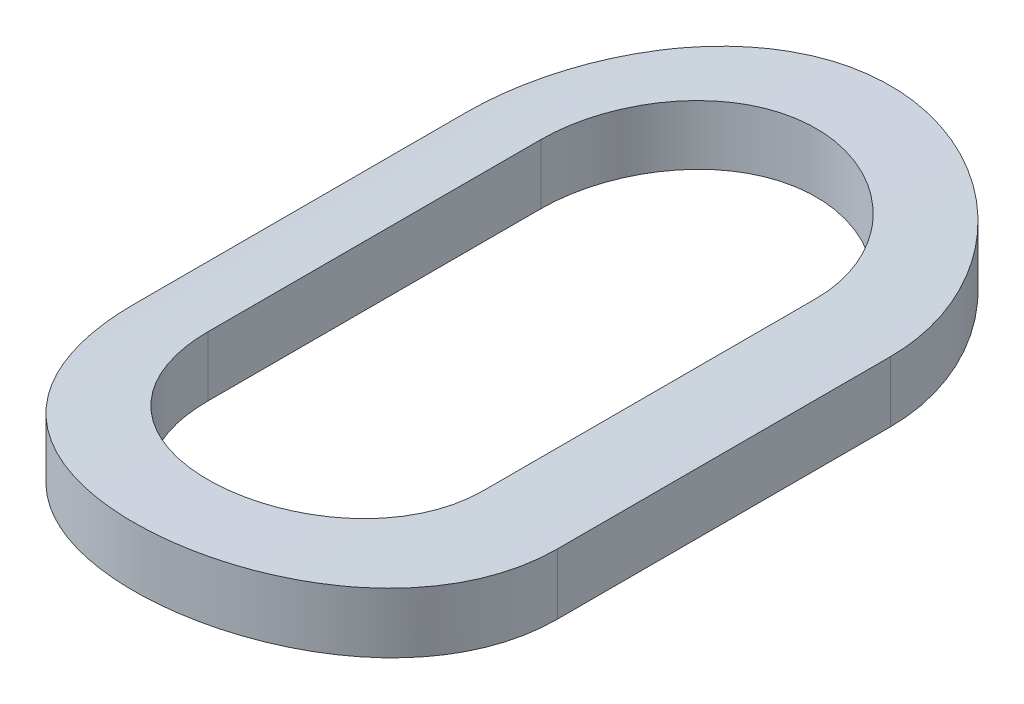
ISO-10303-21;
HEADER;
FILE_DESCRIPTION(('STEP AP214'),'2;1');
FILE_NAME('part.step','',(''),(''),'','','');
FILE_SCHEMA(('AUTOMOTIVE_DESIGN { 1 0 10303 214 1 1 1 1 }'));
ENDSEC;
DATA;
#1=APPLICATION_CONTEXT('core data for automotive mechanical design processes');
#2=APPLICATION_PROTOCOL_DEFINITION('international standard','automotive_design',2000,#1);
#3=PRODUCT_CONTEXT('',#1,'mechanical');
#4=PRODUCT('Part','Part','',(#3));
#5=PRODUCT_RELATED_PRODUCT_CATEGORY('part','',(#4));
#6=PRODUCT_DEFINITION_FORMATION('','',#4);
#7=PRODUCT_DEFINITION_CONTEXT('part definition',#1,'design');
#8=PRODUCT_DEFINITION('design','',#6,#7);
#9=PRODUCT_DEFINITION_SHAPE('','',#8);
#10=(LENGTH_UNIT() NAMED_UNIT(*) SI_UNIT(.MILLI.,.METRE.));
#11=(NAMED_UNIT(*) PLANE_ANGLE_UNIT() SI_UNIT($,.RADIAN.));
#12=(NAMED_UNIT(*) SI_UNIT($,.STERADIAN.) SOLID_ANGLE_UNIT());
#13=UNCERTAINTY_MEASURE_WITH_UNIT(LENGTH_MEASURE(1.E-05),#10,'distance_accuracy_value','');
#14=(GEOMETRIC_REPRESENTATION_CONTEXT(3) GLOBAL_UNCERTAINTY_ASSIGNED_CONTEXT((#13)) GLOBAL_UNIT_ASSIGNED_CONTEXT((#10,
#11,#12)) REPRESENTATION_CONTEXT('',''));
#15=CARTESIAN_POINT('',(0.,0.,0.));
#16=DIRECTION('',(0.,0.,1.));
#17=DIRECTION('',(1.,0.,0.));
#18=AXIS2_PLACEMENT_3D('',#15,#16,#17);
#19=CARTESIAN_POINT('',(-75.4181941684126,-39.6644186635389,0.584683614855494));
#20=DIRECTION('',(0.,0.,1.));
#21=DIRECTION('',(1.,0.,0.));
#22=AXIS2_PLACEMENT_3D('',#19,#20,#21);
#23=CYLINDRICAL_SURFACE('',#22,2.00000000000003);
#24=CARTESIAN_POINT('',(-75.6966157953255,-37.6838931278118,-0.876239996943092));
#25=CARTESIAN_POINT('',(-75.6966294551295,-37.6839002867788,-0.891822988339062));
#26=CARTESIAN_POINT('',(-75.6953084060336,-37.6837094101403,-0.907400283165714));
#27=CARTESIAN_POINT('',(-75.6900997223513,-37.682984903865,-0.938094133465493));
#28=CARTESIAN_POINT('',(-75.6862150067653,-37.682451664063,-0.953211192509957));
#29=CARTESIAN_POINT('',(-75.6759798910917,-37.681095325679,-0.98257693012583));
#30=CARTESIAN_POINT('',(-75.6696287659323,-37.6802721418662,-0.996825351909945));
#31=CARTESIAN_POINT('',(-75.6546490646654,-37.6784312018188,-1.02405406674274));
#32=CARTESIAN_POINT('',(-75.6460206019817,-37.6774134552751,-1.03703442290387));
#33=CARTESIAN_POINT('',(-75.6266675065483,-37.6752897558642,-1.06144691177609));
#34=CARTESIAN_POINT('',(-75.6159304559895,-37.6741833046273,-1.07286915825552));
#35=CARTESIAN_POINT('',(-75.5926907558505,-37.6720113462003,-1.09375706113425));
#36=CARTESIAN_POINT('',(-75.580187837307,-37.6709458452788,-1.10322241893331));
#37=CARTESIAN_POINT('',(-75.553708465243,-37.6689706990596,-1.11996281564447));
#38=CARTESIAN_POINT('',(-75.5397261782164,-37.6680617109434,-1.12722871151884));
#39=CARTESIAN_POINT('',(-75.5107258272774,-37.6665076298967,-1.13930493239215));
#40=CARTESIAN_POINT('',(-75.4957078713967,-37.6658625094904,-1.14411551306883));
#41=CARTESIAN_POINT('',(-75.4651646944313,-37.6649123258311,-1.15111497265981));
#42=CARTESIAN_POINT('',(-75.4496433779763,-37.6646050922705,-1.15332059056577));
#43=CARTESIAN_POINT('',(-75.4184477239863,-37.6643578699444,-1.1550994576686));
#44=CARTESIAN_POINT('',(-75.4027733901594,-37.6644178723014,-1.15467277049826));
#45=CARTESIAN_POINT('',(-75.3718315278119,-37.6648966308364,-1.15121234613978));
#46=CARTESIAN_POINT('',(-75.3565619335515,-37.6653128992251,-1.1481966871707));
#47=CARTESIAN_POINT('',(-75.3267477544281,-37.6664546352049,-1.13967226496746));
#48=CARTESIAN_POINT('',(-75.3122031819229,-37.6671801080642,-1.13416345925504));
#49=CARTESIAN_POINT('',(-75.2841962757678,-37.6688630418128,-1.12079016574371));
#50=CARTESIAN_POINT('',(-75.2707376908188,-37.66982126401,-1.11291792694567));
#51=CARTESIAN_POINT('',(-75.2453263231457,-37.6718626513786,-1.09504723414019));
#52=CARTESIAN_POINT('',(-75.233373564732,-37.6729458185666,-1.0850487458132));
#53=CARTESIAN_POINT('',(-75.2112075527389,-37.6751268689559,-1.06310981584163));
#54=CARTESIAN_POINT('',(-75.2010096555949,-37.676224799518,-1.05115385765984));
#55=CARTESIAN_POINT('',(-75.1827599571932,-37.678302991191,-1.02568812536733));
#56=CARTESIAN_POINT('',(-75.1747087848961,-37.6792832177701,-1.01217789753307));
#57=CARTESIAN_POINT('',(-75.160978686353,-37.6810155063499,-0.983967960314518));
#58=CARTESIAN_POINT('',(-75.1553025839182,-37.6817672964648,-0.969266859691281));
#59=CARTESIAN_POINT('',(-75.1465149521259,-37.6829517101126,-0.939124873922764));
#60=CARTESIAN_POINT('',(-75.1433995707512,-37.6833848129343,-0.923685137049345));
#61=CARTESIAN_POINT('',(-75.1403810235822,-37.6838079660354,-0.897522279264233));
#62=CARTESIAN_POINT('',(-75.1397671156949,-37.6838956949834,-0.886878771292948));
#63=CARTESIAN_POINT('',(-75.1397725414866,-37.6838931278136,-0.876239996943093));
#64=B_SPLINE_CURVE_WITH_KNOTS('',3,(#24,#25,#26,#27,#28,#29,#30,#31,#32,#33,#34,#35,#36,#37,#38,
#39,#40,#41,#42,#43,#44,#45,#46,#47,#48,#49,#50,#51,#52,#53,#54,#55,#56,#57,#58,#59,#60,#61,#62,
#63),.UNSPECIFIED.,.F.,.F.,(4,2,2,2,2,2,2,2,2,2,2,2,2,2,2,2,2,2,2,4),(0.,0.0466834452056831,
0.0933138279590832,0.139957929441397,0.186599708232392,0.233524883020567,0.280457212811403,
0.327582040016522,0.374701959000845,0.421517417926936,0.468331745150025,0.514821812645198,
0.561312672268412,0.607957698215604,0.65460347711198,0.701638704811785,0.748687698077968,
0.79579247182685,0.842826256899453,0.874737605827836),.UNSPECIFIED.);
#65=CARTESIAN_POINT('',(-75.6966157953255,-37.6838931278117,-0.876239996943092));
#66=VERTEX_POINT('',#65);
#67=CARTESIAN_POINT('',(-75.1397725414866,-37.6838931278136,-0.876239996943092));
#68=VERTEX_POINT('',#67);
#69=EDGE_CURVE('E173',#66,#68,#64,.T.);
#70=ORIENTED_EDGE('',*,*,#69,.T.);
#71=DIRECTION('',(0.,0.,1.));
#72=VECTOR('',#71,1.);
#73=CARTESIAN_POINT('',(-75.1397725414866,-37.6838931278136,-0.876239996943092));
#74=LINE('',#73,#72);
#75=CARTESIAN_POINT('',(-75.1397725414866,-37.6838931278136,-0.202724824976197));
#76=VERTEX_POINT('',#75);
#77=EDGE_CURVE('E111',#76,#68,#74,.F.);
#78=ORIENTED_EDGE('',*,*,#77,.F.);
#79=CARTESIAN_POINT('',(-75.1397725414866,-37.6838931278136,-0.202724824976197));
#80=CARTESIAN_POINT('',(-75.1397588796207,-37.6839002866824,-0.187141875815724));
#81=CARTESIAN_POINT('',(-75.1410799225853,-37.6837094111274,-0.171564623124784));
#82=CARTESIAN_POINT('',(-75.1462885944889,-37.6829849067766,-0.140870770455369));
#83=CARTESIAN_POINT('',(-75.1501733182881,-37.6824516659645,-0.125753669298337));
#84=CARTESIAN_POINT('',(-75.1604085498956,-37.6810953115339,-0.0963875867482132));
#85=CARTESIAN_POINT('',(-75.1667598272963,-37.680272107451,-0.0821388779101492));
#86=CARTESIAN_POINT('',(-75.1817396397894,-37.6784311594776,-0.0549102128572708));
#87=CARTESIAN_POINT('',(-75.1903679668946,-37.6774134333571,-0.0419301409126335));
#88=CARTESIAN_POINT('',(-75.2097197306448,-37.6752898729645,-0.0175192623941953));
#89=CARTESIAN_POINT('',(-75.2204553998979,-37.674183547727,-0.00609819521611102));
#90=CARTESIAN_POINT('',(-75.2436949315732,-37.6720115826156,0.0147901596050599));
#91=CARTESIAN_POINT('',(-75.2561994511821,-37.6709459580511,0.0242567178534133));
#92=CARTESIAN_POINT('',(-75.2826865812824,-37.6689701638389,0.0410024530265598));
#93=CARTESIAN_POINT('',(-75.2966756305399,-37.6680607202235,0.0482715274875144));
#94=CARTESIAN_POINT('',(-75.3256802616352,-37.6665069471062,0.0603454748179817));
#95=CARTESIAN_POINT('',(-75.3406946165842,-37.6658623070036,0.0651532363208052));
#96=CARTESIAN_POINT('',(-75.3661906867543,-37.6650687404204,0.0709972326101154));
#97=CARTESIAN_POINT('',(-75.3765094630458,-37.6648261366692,0.0727570153848015));
#98=CARTESIAN_POINT('',(-75.3972820582867,-37.6645010155628,0.0751070323404389));
#99=CARTESIAN_POINT('',(-75.4077358788047,-37.6644185000687,0.0756972529250167));
#100=CARTESIAN_POINT('',(-75.4337519183814,-37.6644189067171,0.075696131062859));
#101=CARTESIAN_POINT('',(-75.4493195582294,-37.6646021145815,0.0743883315936385));
#102=CARTESIAN_POINT('',(-75.4800209223931,-37.6653153707963,0.0691923537689351));
#103=CARTESIAN_POINT('',(-75.4951541758997,-37.6658457816674,0.0653014783179241));
#104=CARTESIAN_POINT('',(-75.524537296991,-37.6671937576897,0.05505717320836));
#105=CARTESIAN_POINT('',(-75.5387878109929,-37.6680111097223,0.0487055708334273));
#106=CARTESIAN_POINT('',(-75.5660183827943,-37.6698423970419,0.0337241325303183));
#107=CARTESIAN_POINT('',(-75.5789986259308,-37.6708563035864,0.0250946296373307));
#108=CARTESIAN_POINT('',(-75.6034100675533,-37.6729753872155,0.00574041051213061));
#109=CARTESIAN_POINT('',(-75.6148314615178,-37.6740810774153,-0.00499661651705337));
#110=CARTESIAN_POINT('',(-75.6357169845139,-37.6762550992279,-0.028235606016278));
#111=CARTESIAN_POINT('',(-75.6451809299362,-37.6773234273283,-0.040737733868503));
#112=CARTESIAN_POINT('',(-75.6619217538811,-37.6793069555814,-0.067218355841516));
#113=CARTESIAN_POINT('',(-75.6691886877188,-37.6802214513813,-0.0812031871383846));
#114=CARTESIAN_POINT('',(-75.6812636393248,-37.6817861316722,-0.110207626004513));
#115=CARTESIAN_POINT('',(-75.6860730762994,-37.6824364686703,-0.12522663063779));
#116=CARTESIAN_POINT('',(-75.691918595569,-37.6832370693846,-0.150733239253849));
#117=CARTESIAN_POINT('',(-75.6936785663991,-37.6834818214154,-0.16105779292555));
#118=CARTESIAN_POINT('',(-75.6960272293276,-37.6838103779396,-0.181828299548342));
#119=CARTESIAN_POINT('',(-75.6966174212662,-37.6838943885239,-0.192274079750703));
#120=CARTESIAN_POINT('',(-75.6966157953255,-37.6838931278118,-0.202724824976196));
#121=B_SPLINE_CURVE_WITH_KNOTS('',3,(#79,#80,#81,#82,#83,#84,#85,#86,#87,#88,#89,#90,#91,#92,
#93,#94,#95,#96,#97,#98,#99,#100,#101,#102,#103,#104,#105,#106,#107,#108,#109,#110,#111,#112,
#113,#114,#115,#116,#117,#118,#119,#120),.UNSPECIFIED.,.F.,.F.,(4,2,2,2,2,2,2,2,2,2,2,2,2,2,2,2,
2,2,2,2,4),(0.,0.0466833192223591,0.0933138279618848,0.139958897647051,0.186599708214385,
0.233519721309547,0.280457212757857,0.327607317912903,0.374701959415364,0.406050734595149,
0.43739987420802,0.484034849393509,0.530718594814153,0.577367740117316,0.624010068963721,
0.670933427045884,0.717861184561647,0.76499828353773,0.812108129951288,0.843474060832562,
0.87479974958086),.UNSPECIFIED.);
#122=CARTESIAN_POINT('',(-75.6966157953255,-37.6838931278117,-0.202724824976197));
#123=VERTEX_POINT('',#122);
#124=EDGE_CURVE('E118',#76,#123,#121,.T.);
#125=ORIENTED_EDGE('',*,*,#124,.T.);
#126=DIRECTION('',(0.,0.,-1.));
#127=VECTOR('',#126,1.);
#128=CARTESIAN_POINT('',(-75.6966157953255,-37.6838931278117,-0.202724824976197));
#129=LINE('',#128,#127);
#130=EDGE_CURVE('E115',#66,#123,#129,.F.);
#131=ORIENTED_EDGE('',*,*,#130,.F.);
#132=EDGE_LOOP('',(#70,#78,#125,#131));
#133=FACE_BOUND('',#132,.T.);
#134=DIRECTION('',(0.,0.,1.));
#135=VECTOR('',#134,1.);
#136=CARTESIAN_POINT('',(-75.8466157953255,-37.7108437585011,-0.876240032109577));
#137=LINE('',#136,#135);
#138=CARTESIAN_POINT('',(-75.8466157953255,-37.7108437585011,-0.202724790492689));
#139=VERTEX_POINT('',#138);
#140=CARTESIAN_POINT('',(-75.8466157953255,-37.7108437585011,-0.876240005734713));
#141=VERTEX_POINT('',#140);
#142=EDGE_CURVE('E98',#139,#141,#137,.F.);
#143=ORIENTED_EDGE('',*,*,#142,.F.);
#144=CARTESIAN_POINT('',(-74.9897725414865,-37.710843758504,-0.202724807392955));
#145=CARTESIAN_POINT('',(-74.9897507874872,-37.7108609265628,-0.178916264039238));
#146=CARTESIAN_POINT('',(-74.9917557491165,-37.7104089707995,-0.155120190975714));
#147=CARTESIAN_POINT('',(-74.999650902421,-37.7086961520659,-0.108250846783709));
#148=CARTESIAN_POINT('',(-75.0055345436485,-37.7074366530006,-0.0851764256030853));
#149=CARTESIAN_POINT('',(-75.0210204579143,-37.7042371635132,-0.0403619330537329));
#150=CARTESIAN_POINT('',(-75.0306230085622,-37.7022971222908,-0.0186219614395645));
#151=CARTESIAN_POINT('',(-75.0532571160442,-37.6979614029511,0.0229426766864763));
#152=CARTESIAN_POINT('',(-75.0662890477629,-37.6955656750281,0.0427671334786615));
#153=CARTESIAN_POINT('',(-75.0956349864136,-37.690544432848,0.0802511756091923));
#154=CARTESIAN_POINT('',(-75.1119933672644,-37.6879161167228,0.0978756506127935));
#155=CARTESIAN_POINT('',(-75.1474378541796,-37.6827498539249,0.130157807886158));
#156=CARTESIAN_POINT('',(-75.1665249471919,-37.6802119403665,0.144814412051613));
#157=CARTESIAN_POINT('',(-75.2071251883386,-37.6754813678396,0.170883484881072));
#158=CARTESIAN_POINT('',(-75.2286616387265,-37.6732926006761,0.182260391639395));
#159=CARTESIAN_POINT('',(-75.2733799678486,-37.6695426855915,0.201208603245909));
#160=CARTESIAN_POINT('',(-75.2965598533901,-37.6679807922026,0.208784430971424));
#161=CARTESIAN_POINT('',(-75.3362486728265,-37.6660333465672,0.218109848413749));
#162=CARTESIAN_POINT('',(-75.3524990546746,-37.6654308897503,0.220950362017127));
#163=CARTESIAN_POINT('',(-75.3852287367011,-37.6646233603424,0.224744193452579));
#164=CARTESIAN_POINT('',(-75.4017080360753,-37.6644182863556,0.225697517912644));
#165=CARTESIAN_POINT('',(-75.4419623491601,-37.6644192073268,0.225695769724814));
#166=CARTESIAN_POINT('',(-75.4657447323547,-37.6648467855909,0.223711744879925));
#167=CARTESIAN_POINT('',(-75.5126388085993,-37.6665116653701,0.215834300659908));
#168=CARTESIAN_POINT('',(-75.5357498150832,-37.6677497672734,0.209937016881518));
#169=CARTESIAN_POINT('',(-75.5806103014741,-37.6708976140934,0.194425759111658));
#170=CARTESIAN_POINT('',(-75.6023612917017,-37.6728065977997,0.184815996231321));
#171=CARTESIAN_POINT('',(-75.6439403691954,-37.6770897814008,0.162164701665067));
#172=CARTESIAN_POINT('',(-75.663768588751,-37.6794639492563,0.149123406303254));
#173=CARTESIAN_POINT('',(-75.7012470539439,-37.684458088384,0.119766353412596));
#174=CARTESIAN_POINT('',(-75.7188634133386,-37.6870810031852,0.103407834028383));
#175=CARTESIAN_POINT('',(-75.75112514488,-37.6922562593745,0.0679710183361009));
#176=CARTESIAN_POINT('',(-75.7657701321695,-37.6948085915837,0.0488923702564001));
#177=CARTESIAN_POINT('',(-75.7918237217925,-37.6995830774688,0.00830582987881822));
#178=CARTESIAN_POINT('',(-75.8031955772302,-37.7018013582123,-0.0132261215922169));
#179=CARTESIAN_POINT('',(-75.822140978803,-37.7056126660641,-0.0579465919613328));
#180=CARTESIAN_POINT('',(-75.8297170999801,-37.7072061168997,-0.081133975573538));
#181=CARTESIAN_POINT('',(-75.8390384702135,-37.7091936050441,-0.120830331534628));
#182=CARTESIAN_POINT('',(-75.8418763753409,-37.7098087541299,-0.137080020439734));
#183=CARTESIAN_POINT('',(-75.8456657770817,-37.7106354008836,-0.169792031080277));
#184=CARTESIAN_POINT('',(-75.8466190711686,-37.7108472831656,-0.186254135120177));
#185=CARTESIAN_POINT('',(-75.8466157953254,-37.7108437585011,-0.20272479049269));
#186=B_SPLINE_CURVE_WITH_KNOTS('',3,(#144,#145,#146,#147,#148,#149,#150,#151,#152,#153,#154,
#155,#156,#157,#158,#159,#160,#161,#162,#163,#164,#165,#166,#167,#168,#169,#170,#171,#172,#173,
#174,#175,#176,#177,#178,#179,#180,#181,#182,#183,#184,#185),.UNSPECIFIED.,.F.,.F.,(4,2,2,2,2,2,
2,2,2,2,2,2,2,2,2,2,2,2,2,2,4),(0.,0.0713180928670409,0.142516048786508,0.213719320525464,
0.284930379125407,0.35716232981658,0.429420472492335,0.502434936871058,0.575362314580187,
0.624778709813908,0.674194931492181,0.7454386692875,0.816752866276427,0.88798640708201,
0.959215043431965,1.03142804918488,1.10365040213046,1.17665449944604,1.24960900318434,
1.29902300932562,1.34838986340816),.UNSPECIFIED.);
#187=CARTESIAN_POINT('',(-74.9897725414866,-37.710843758504,-0.202724816184576));
#188=VERTEX_POINT('',#187);
#189=EDGE_CURVE('E21',#188,#139,#186,.T.);
#190=ORIENTED_EDGE('',*,*,#189,.F.);
#191=DIRECTION('',(0.,0.,-1.));
#192=VECTOR('',#191,1.);
#193=CARTESIAN_POINT('',(-74.9897725414866,-37.7108437585039,-0.202724789809712));
#194=LINE('',#193,#192);
#195=CARTESIAN_POINT('',(-74.9897725414866,-37.710843758504,-0.876240030729819));
#196=VERTEX_POINT('',#195);
#197=EDGE_CURVE('E85',#196,#188,#194,.F.);
#198=ORIENTED_EDGE('',*,*,#197,.F.);
#199=CARTESIAN_POINT('',(-75.8466157953255,-37.7108437585011,-0.876240014526335));
#200=CARTESIAN_POINT('',(-75.8466375462383,-37.710860926741,-0.900048594074317));
#201=CARTESIAN_POINT('',(-75.8446325800499,-37.710408969512,-0.923844703290382));
#202=CARTESIAN_POINT('',(-75.8367374180647,-37.7086961481775,-0.970714045469842));
#203=CARTESIAN_POINT('',(-75.8308537844985,-37.7074366504302,-0.993788430556181));
#204=CARTESIAN_POINT('',(-75.815368021635,-37.7042371937784,-1.03860246663482));
#205=CARTESIAN_POINT('',(-75.8057656791143,-37.7022971958559,-1.06034204100885));
#206=CARTESIAN_POINT('',(-75.7831317253111,-37.697961493391,-1.10190674717698));
#207=CARTESIAN_POINT('',(-75.7700996100327,-37.6955657218882,-1.12173159702165));
#208=CARTESIAN_POINT('',(-75.7407517754949,-37.6905441715474,-1.15921795681255));
#209=CARTESIAN_POINT('',(-75.7243914109984,-37.6879155738663,-1.17684414389821));
#210=CARTESIAN_POINT('',(-75.6889466889083,-37.6827493250895,-1.20912565458795));
#211=CARTESIAN_POINT('',(-75.6698619071841,-37.6802116882315,-1.22378051476163));
#212=CARTESIAN_POINT('',(-75.6292730690832,-37.6754826039508,-1.24984160462365));
#213=CARTESIAN_POINT('',(-75.6077466269489,-37.6732948919729,-1.26121370599332));
#214=CARTESIAN_POINT('',(-75.5630347833723,-37.6695442824693,-1.28016528909403));
#215=CARTESIAN_POINT('',(-75.5398496490479,-37.6679812846045,-1.28774537993108));
#216=CARTESIAN_POINT('',(-75.4928474837554,-37.6656760727888,-1.29878698168752));
#217=CARTESIAN_POINT('',(-75.4690451959955,-37.6649218707293,-1.30230870669274));
#218=CARTESIAN_POINT('',(-75.4211759451345,-37.6642777190988,-1.30532179491107));
#219=CARTESIAN_POINT('',(-75.397109005236,-37.6643876943566,-1.30481350867701));
#220=CARTESIAN_POINT('',(-75.3498095537472,-37.6654503456381,-1.29982590080055));
#221=CARTESIAN_POINT('',(-75.3265698337533,-37.6663892293919,-1.29541156943507));
#222=CARTESIAN_POINT('',(-75.2811690561258,-37.6689885160083,-1.28284066428051));
#223=CARTESIAN_POINT('',(-75.259008037602,-37.6706489450101,-1.27468395491748));
#224=CARTESIAN_POINT('',(-75.2162115567761,-37.6745271051459,-1.25480152790912));
#225=CARTESIAN_POINT('',(-75.195588024803,-37.6767487041271,-1.24305091574832));
#226=CARTESIAN_POINT('',(-75.1565823887011,-37.6815051641751,-1.21633314830918));
#227=CARTESIAN_POINT('',(-75.1382005116553,-37.6840400569267,-1.20136566758077));
#228=CARTESIAN_POINT('',(-75.103814917621,-37.6892036380501,-1.16828644713463));
#229=CARTESIAN_POINT('',(-75.0878656656595,-37.6918331894257,-1.15011817853824));
#230=CARTESIAN_POINT('',(-75.0592267773114,-37.6968428248063,-1.11133286792177));
#231=CARTESIAN_POINT('',(-75.0465380362665,-37.6992228401823,-1.09071515554836));
#232=CARTESIAN_POINT('',(-75.0247552174354,-37.703467582625,-1.04752367972012));
#233=CARTESIAN_POINT('',(-75.0156731178673,-37.7053305865483,-1.02494369688324));
#234=CARTESIAN_POINT('',(-75.0014654306675,-37.7083017923708,-0.978554527527486));
#235=CARTESIAN_POINT('',(-74.9963339512501,-37.7094111179819,-0.954747228177648));
#236=CARTESIAN_POINT('',(-74.9909289025459,-37.7105911114106,-0.912627636159722));
#237=CARTESIAN_POINT('',(-74.9897608957576,-37.7108522538644,-0.894431445390322));
#238=CARTESIAN_POINT('',(-74.9897725414865,-37.7108437585039,-0.876240030729819));
#239=B_SPLINE_CURVE_WITH_KNOTS('',3,(#199,#200,#201,#202,#203,#204,#205,#206,#207,#208,#209,
#210,#211,#212,#213,#214,#215,#216,#217,#218,#219,#220,#221,#222,#223,#224,#225,#226,#227,#228,
#229,#230,#231,#232,#233,#234,#235,#236,#237,#238),.UNSPECIFIED.,.F.,.F.,(4,2,2,2,2,2,2,2,2,2,2,
2,2,2,2,2,2,2,2,4),(0.,0.0713182009212705,0.142516048781537,0.213717979592348,0.284930379185432,
0.357169796743257,0.429420472648852,0.502397255709573,0.575362312831936,0.647230251696667,
0.719091939156237,0.789779986054084,0.86047059394756,0.931662403758345,1.00286141942651,
1.07547409467872,1.14810668823571,1.22097852800716,1.29374147817563,1.34829217205201),.UNSPECIFIED.);
#240=EDGE_CURVE('E99',#141,#196,#239,.T.);
#241=ORIENTED_EDGE('',*,*,#240,.F.);
#242=EDGE_LOOP('',(#143,#190,#198,#241));
#243=FACE_BOUND('',#242,.T.);
#244=ADVANCED_FACE('F17',(#133,#243),#23,.T.);
#245=CARTESIAN_POINT('',(-75.8466157953255,-36.7841716842097,-0.876240032109577));
#246=DIRECTION('',(-1.,0.,0.));
#247=DIRECTION('',(0.,0.,1.));
#248=AXIS2_PLACEMENT_3D('',#245,#246,#247);
#249=PLANE('',#248);
#250=ORIENTED_EDGE('',*,*,#142,.T.);
#251=DIRECTION('',(0.,1.,0.));
#252=VECTOR('',#251,1.);
#253=CARTESIAN_POINT('',(-75.8466157953255,-36.7841716842097,-0.876240014526334));
#254=LINE('',#253,#252);
#255=CARTESIAN_POINT('',(-75.8466157953255,-37.8338846131609,-0.876240005734713));
#256=VERTEX_POINT('',#255);
#257=EDGE_CURVE('E168',#256,#141,#254,.T.);
#258=ORIENTED_EDGE('',*,*,#257,.F.);
#259=DIRECTION('',(0.,0.,1.));
#260=VECTOR('',#259,1.);
#261=CARTESIAN_POINT('',(-75.8466157953255,-37.8338846131609,0.584683614855494));
#262=LINE('',#261,#260);
#263=CARTESIAN_POINT('',(-75.8466157953254,-37.8338846131609,-0.202724790492689));
#264=VERTEX_POINT('',#263);
#265=EDGE_CURVE('E106',#256,#264,#262,.T.);
#266=ORIENTED_EDGE('',*,*,#265,.T.);
#267=DIRECTION('',(0.,1.,0.));
#268=VECTOR('',#267,1.);
#269=CARTESIAN_POINT('',(-75.8466157953254,-36.7841716842097,-0.202724790492689));
#270=LINE('',#269,#268);
#271=EDGE_CURVE('E93',#139,#264,#270,.F.);
#272=ORIENTED_EDGE('',*,*,#271,.F.);
#273=EDGE_LOOP('',(#250,#258,#266,#272));
#274=FACE_BOUND('',#273,.T.);
#275=ADVANCED_FACE('F105',(#274),#249,.T.);
#276=CARTESIAN_POINT('',(-75.418194168406,-36.7841716842097,-0.202724824976197));
#277=DIRECTION('',(0.,1.,0.));
#278=DIRECTION('',(0.,0.,1.));
#279=AXIS2_PLACEMENT_3D('',#276,#277,#278);
#280=CYLINDRICAL_SURFACE('',#279,0.428421626919453);
#281=DIRECTION('',(0.,1.,0.));
#282=VECTOR('',#281,1.);
#283=CARTESIAN_POINT('',(-74.9897725414866,-36.7841716842097,-0.202724807392955));
#284=LINE('',#283,#282);
#285=CARTESIAN_POINT('',(-74.9897725414866,-37.8338846131639,-0.202724816184576));
#286=VERTEX_POINT('',#285);
#287=EDGE_CURVE('E95',#188,#286,#284,.F.);
#288=ORIENTED_EDGE('',*,*,#287,.F.);
#289=ORIENTED_EDGE('',*,*,#189,.T.);
#290=ORIENTED_EDGE('',*,*,#271,.T.);
#291=CARTESIAN_POINT('',(-75.8466157953254,-37.8338846131609,-0.202724790492689));
#292=CARTESIAN_POINT('',(-75.846637711794,-37.8339029304359,-0.178955142377862));
#293=CARTESIAN_POINT('',(-75.8446390938469,-37.8334221121681,-0.155198822576091));
#294=CARTESIAN_POINT('',(-75.8367712400927,-37.8316005664174,-0.108412163562232));
#295=CARTESIAN_POINT('',(-75.8309090173249,-37.830261397095,-0.0853805880422277));
#296=CARTESIAN_POINT('',(-75.8154831385873,-37.8268605525461,-0.0406514984809671));
#297=CARTESIAN_POINT('',(-75.805919409683,-37.8247988630832,-0.018954010736293));
#298=CARTESIAN_POINT('',(-75.7833800232617,-37.8201919833291,0.0225339965644699));
#299=CARTESIAN_POINT('',(-75.7704038387159,-37.8176467183701,0.042324220911986));
#300=CARTESIAN_POINT('',(-75.7411566266589,-37.8123066382364,0.0797894982224333));
#301=CARTESIAN_POINT('',(-75.7248354807378,-37.8095084397629,0.0974249502078775));
#302=CARTESIAN_POINT('',(-75.6894641112228,-37.8040067503935,0.129738190448513));
#303=CARTESIAN_POINT('',(-75.6704129049867,-37.8013032940366,0.1444149091566));
#304=CARTESIAN_POINT('',(-75.629849394204,-37.7962579783425,0.170552953314752));
#305=CARTESIAN_POINT('',(-75.6083105678603,-37.793920790548,0.181974056887055));
#306=CARTESIAN_POINT('',(-75.5635722299153,-37.7899140702946,0.201007539948136));
#307=CARTESIAN_POINT('',(-75.5403747360887,-37.7882437423591,0.208624460069106));
#308=CARTESIAN_POINT('',(-75.5005812730639,-37.7861551063762,0.218027060247779));
#309=CARTESIAN_POINT('',(-75.4842455989693,-37.7855072523778,0.220898457159879));
#310=CARTESIAN_POINT('',(-75.4513402768667,-37.7846388332883,0.224733680908797));
#311=CARTESIAN_POINT('',(-75.4347706305882,-37.7844182650408,0.225697521837354));
#312=CARTESIAN_POINT('',(-75.3944645952933,-37.7844192339978,0.225695771398895));
#313=CARTESIAN_POINT('',(-75.370721054651,-37.7848726218248,0.223718109068547));
#314=CARTESIAN_POINT('',(-75.3239053141724,-37.7866380562427,0.215867096948843));
#315=CARTESIAN_POINT('',(-75.3008337922137,-37.7879509404904,0.209989946681154));
#316=CARTESIAN_POINT('',(-75.2560527281115,-37.7912892435697,0.194535154423175));
#317=CARTESIAN_POINT('',(-75.2343415637089,-37.7933137939047,0.184962021508676));
#318=CARTESIAN_POINT('',(-75.1928351609476,-37.7978577032156,0.16240053494043));
#319=CARTESIAN_POINT('',(-75.1730398218632,-37.8003770361569,0.149412360968258));
#320=CARTESIAN_POINT('',(-75.135582099526,-37.8056840808167,0.120151400956052));
#321=CARTESIAN_POINT('',(-75.1179576420719,-37.8084753546924,0.103830709358296));
#322=CARTESIAN_POINT('',(-75.0856702794301,-37.8139871590399,0.0684692564156057));
#323=CARTESIAN_POINT('',(-75.0710077879245,-37.8167076795837,0.0494281157529326));
#324=CARTESIAN_POINT('',(-75.044888042797,-37.8218057334104,0.00887971416318393));
#325=CARTESIAN_POINT('',(-75.0334726598055,-37.8241786101587,-0.0126551268808518));
#326=CARTESIAN_POINT('',(-75.0144435137885,-37.8282594376278,-0.0573962363537866));
#327=CARTESIAN_POINT('',(-75.0068270760236,-37.8299678559896,-0.0806013156011482));
#328=CARTESIAN_POINT('',(-74.9974306136454,-37.8321049852984,-0.12039961455176));
#329=CARTESIAN_POINT('',(-74.9945627659019,-37.8327682788123,-0.136731621885685));
#330=CARTESIAN_POINT('',(-74.9907328242145,-37.8336598491953,-0.169614560692485));
#331=CARTESIAN_POINT('',(-74.9897690709116,-37.8338885048312,-0.186165288881065));
#332=CARTESIAN_POINT('',(-74.9897725414865,-37.8338846131639,-0.202724807392956));
#333=B_SPLINE_CURVE_WITH_KNOTS('',3,(#291,#292,#293,#294,#295,#296,#297,#298,#299,#300,#301,
#302,#303,#304,#305,#306,#307,#308,#309,#310,#311,#312,#313,#314,#315,#316,#317,#318,#319,#320,
#321,#322,#323,#324,#325,#326,#327,#328,#329,#330,#331,#332),.UNSPECIFIED.,.F.,.F.,(4,2,2,2,2,2,
2,2,2,2,2,2,2,2,2,2,2,2,2,2,4),(0.,0.0711998516915185,0.142270819288181,0.213343187336033,
0.284426538444008,0.356665086428148,0.428929701152106,0.502051838427475,0.575086488074149,
0.624773459966301,0.67446006480317,0.745587541175329,0.816784441094152,0.887894754321384,
0.95900132684478,1.03121287628064,1.10343450416351,1.17654907288925,1.24961209060781,
1.2992877858014,1.34892017104762),.UNSPECIFIED.);
#334=EDGE_CURVE('E150',#264,#286,#333,.T.);
#335=ORIENTED_EDGE('',*,*,#334,.T.);
#336=EDGE_LOOP('',(#288,#289,#290,#335));
#337=FACE_BOUND('',#336,.T.);
#338=ADVANCED_FACE('F91',(#337),#280,.T.);
#339=CARTESIAN_POINT('',(-74.9897725414866,-36.7841716842097,-0.202724789809712));
#340=DIRECTION('',(1.,0.,0.));
#341=DIRECTION('',(0.,0.,-1.));
#342=AXIS2_PLACEMENT_3D('',#339,#340,#341);
#343=PLANE('',#342);
#344=ORIENTED_EDGE('',*,*,#197,.T.);
#345=ORIENTED_EDGE('',*,*,#287,.T.);
#346=DIRECTION('',(0.,0.,1.));
#347=VECTOR('',#346,1.);
#348=CARTESIAN_POINT('',(-74.9897725414866,-37.8338846131639,0.584683614855494));
#349=LINE('',#348,#347);
#350=CARTESIAN_POINT('',(-74.9897725414866,-37.8338846131639,-0.876240030729819));
#351=VERTEX_POINT('',#350);
#352=EDGE_CURVE('E149',#286,#351,#349,.F.);
#353=ORIENTED_EDGE('',*,*,#352,.T.);
#354=DIRECTION('',(0.,1.,0.));
#355=VECTOR('',#354,1.);
#356=CARTESIAN_POINT('',(-74.9897725414866,-36.7841716842097,-0.876240030729819));
#357=LINE('',#356,#355);
#358=EDGE_CURVE('E114',#196,#351,#357,.F.);
#359=ORIENTED_EDGE('',*,*,#358,.F.);
#360=EDGE_LOOP('',(#344,#345,#353,#359));
#361=FACE_BOUND('',#360,.T.);
#362=ADVANCED_FACE('F161',(#361),#343,.T.);
#363=CARTESIAN_POINT('',(-75.418194168406,-36.7841716842097,-0.876239996943092));
#364=DIRECTION('',(0.,1.,0.));
#365=DIRECTION('',(0.,0.,1.));
#366=AXIS2_PLACEMENT_3D('',#363,#364,#365);
#367=CYLINDRICAL_SURFACE('',#366,0.428421626919453);
#368=ORIENTED_EDGE('',*,*,#358,.T.);
#369=CARTESIAN_POINT('',(-74.9897725414866,-37.8338846131639,-0.876240030729819));
#370=CARTESIAN_POINT('',(-74.9897506280449,-37.8339029306288,-0.900009708919274));
#371=CARTESIAN_POINT('',(-74.9917492494855,-37.8334221110613,-0.923766058784205));
#372=CARTESIAN_POINT('',(-74.9996171098605,-37.8316005630049,-0.970552716145141));
#373=CARTESIAN_POINT('',(-75.0054793259795,-37.8302613948483,-0.993584261674269));
#374=CARTESIAN_POINT('',(-75.0209050590588,-37.8268605840483,-1.0383129109393));
#375=CARTESIAN_POINT('',(-75.0304685855066,-37.824798939553,-1.06001001125447));
#376=CARTESIAN_POINT('',(-75.0530078220031,-37.8201920773174,-1.10149808476446));
#377=CARTESIAN_POINT('',(-75.0659841846185,-37.8176467671214,-1.12128869242995));
#378=CARTESIAN_POINT('',(-75.0952332581852,-37.8123063642183,-1.15875625115467));
#379=CARTESIAN_POINT('',(-75.1115563556826,-37.8095078702986,-1.17639339177898));
#380=CARTESIAN_POINT('',(-75.146927954892,-37.8040061954296,-1.2087059964729));
#381=CARTESIAN_POINT('',(-75.1659768843553,-37.8013030295228,-1.22338099483542));
#382=CARTESIAN_POINT('',(-75.2065291157301,-37.7962592854266,-1.2495111115143));
#383=CARTESIAN_POINT('',(-75.2280580268001,-37.7939232140904,-1.26092743130407));
#384=CARTESIAN_POINT('',(-75.2727899046752,-37.789915763612,-1.27996425586564));
#385=CARTESIAN_POINT('',(-75.2959925798783,-37.7882442690165,-1.28758542000678));
#386=CARTESIAN_POINT('',(-75.342997083492,-37.7857782913354,-1.29868969009608));
#387=CARTESIAN_POINT('',(-75.3667820957526,-37.7849694264943,-1.30224073063725));
#388=CARTESIAN_POINT('',(-75.4146236265043,-37.7842699284381,-1.30531661283443));
#389=CARTESIAN_POINT('',(-75.4386801172991,-37.7843792023855,-1.3048418615581));
#390=CARTESIAN_POINT('',(-75.4859114780833,-37.7854927931288,-1.29992959493592));
#391=CARTESIAN_POINT('',(-75.5090944249684,-37.7864805427984,-1.29556542674788));
#392=CARTESIAN_POINT('',(-75.5543897592241,-37.7892210984573,-1.28311541303431));
#393=CARTESIAN_POINT('',(-75.5765021043123,-37.7909739346359,-1.27502942065079));
#394=CARTESIAN_POINT('',(-75.619229753744,-37.7950740223035,-1.25530186386299));
#395=CARTESIAN_POINT('',(-75.63983196443,-37.7974258255652,-1.24363292504405));
#396=CARTESIAN_POINT('',(-75.6788116951176,-37.8024666367991,-1.21709149372552));
#397=CARTESIAN_POINT('',(-75.6971889486927,-37.8051556850763,-1.20221861816339));
#398=CARTESIAN_POINT('',(-75.7316323407319,-37.8106473883086,-1.16929597639779));
#399=CARTESIAN_POINT('',(-75.7476373265574,-37.8134512384332,-1.15118238022767));
#400=CARTESIAN_POINT('',(-75.7763985233433,-37.8188010567262,-1.11249352458114));
#401=CARTESIAN_POINT('',(-75.7891538462573,-37.8213469542889,-1.09191759446727));
#402=CARTESIAN_POINT('',(-75.8110847952055,-37.8258965985987,-1.04878023186378));
#403=CARTESIAN_POINT('',(-75.8202459505,-37.8278981439733,-1.02621121236858));
#404=CARTESIAN_POINT('',(-75.8346144723176,-37.8311022038516,-0.979811304449623));
#405=CARTESIAN_POINT('',(-75.839827729827,-37.8323059085435,-0.955982353147545));
#406=CARTESIAN_POINT('',(-75.8441949537064,-37.8333194586835,-0.922668537166074));
#407=CARTESIAN_POINT('',(-75.8451030055186,-37.8335311106148,-0.91339942551446));
#408=CARTESIAN_POINT('',(-75.8463127040109,-37.8338135981246,-0.894834980894434));
#409=CARTESIAN_POINT('',(-75.8466153517811,-37.8338846661691,-0.885539716708439));
#410=CARTESIAN_POINT('',(-75.8466157953255,-37.8338846131608,-0.876240014526332));
#411=B_SPLINE_CURVE_WITH_KNOTS('',3,(#369,#370,#371,#372,#373,#374,#375,#376,#377,#378,#379,
#380,#381,#382,#383,#384,#385,#386,#387,#388,#389,#390,#391,#392,#393,#394,#395,#396,#397,#398,
#399,#400,#401,#402,#403,#404,#405,#406,#407,#408,#409,#410),.UNSPECIFIED.,.F.,.F.,(4,2,2,2,2,2,
2,2,2,2,2,2,2,2,2,2,2,2,2,2,4),(0.,0.0711999415163353,0.142270819269591,0.2133418791996,
0.28442653848317,0.356672445057091,0.428929701278491,0.50201444473637,0.575086486036382,
0.646920255962582,0.718746762508859,0.78924676072924,0.859749541019596,0.930804975521325,
1.00186891012734,1.07452836426502,1.14720765305201,1.2201766298143,1.29303650778515,
1.32096781078779,1.34885288855905),.UNSPECIFIED.);
#412=EDGE_CURVE('E142',#351,#256,#411,.T.);
#413=ORIENTED_EDGE('',*,*,#412,.T.);
#414=ORIENTED_EDGE('',*,*,#257,.T.);
#415=ORIENTED_EDGE('',*,*,#240,.T.);
#416=EDGE_LOOP('',(#368,#413,#414,#415));
#417=FACE_BOUND('',#416,.T.);
#418=ADVANCED_FACE('F155',(#417),#367,.T.);
#419=CARTESIAN_POINT('',(-75.1397725414866,-36.7841716842097,-0.876239996943092));
#420=DIRECTION('',(-1.,0.,0.));
#421=DIRECTION('',(0.,0.,1.));
#422=AXIS2_PLACEMENT_3D('',#419,#420,#421);
#423=PLANE('',#422);
#424=ORIENTED_EDGE('',*,*,#77,.T.);
#425=DIRECTION('',(0.,1.,0.));
#426=VECTOR('',#425,1.);
#427=CARTESIAN_POINT('',(-75.1397725414866,-36.7841716842097,-0.876239996943092));
#428=LINE('',#427,#426);
#429=CARTESIAN_POINT('',(-75.1397725414866,-37.8051496142456,-0.876239996943092));
#430=VERTEX_POINT('',#429);
#431=EDGE_CURVE('E211',#68,#430,#428,.F.);
#432=ORIENTED_EDGE('',*,*,#431,.T.);
#433=DIRECTION('',(0.,0.,1.));
#434=VECTOR('',#433,1.);
#435=CARTESIAN_POINT('',(-75.1397725414866,-37.8051496142456,0.584683614855494));
#436=LINE('',#435,#434);
#437=CARTESIAN_POINT('',(-75.1397725414866,-37.8051496142456,-0.202724824976197));
#438=VERTEX_POINT('',#437);
#439=EDGE_CURVE('E148',#430,#438,#436,.T.);
#440=ORIENTED_EDGE('',*,*,#439,.T.);
#441=DIRECTION('',(0.,1.,0.));
#442=VECTOR('',#441,1.);
#443=CARTESIAN_POINT('',(-75.1397725414866,-36.7841716842097,-0.202724824976197));
#444=LINE('',#443,#442);
#445=EDGE_CURVE('E113',#438,#76,#444,.T.);
#446=ORIENTED_EDGE('',*,*,#445,.T.);
#447=EDGE_LOOP('',(#424,#432,#440,#446));
#448=FACE_BOUND('',#447,.T.);
#449=ADVANCED_FACE('F160',(#448),#423,.T.);
#450=CARTESIAN_POINT('',(-75.418194168406,-36.7841716842097,-0.202724824976197));
#451=DIRECTION('',(0.,1.,0.));
#452=DIRECTION('',(0.,0.,1.));
#453=AXIS2_PLACEMENT_3D('',#450,#451,#452);
#454=CYLINDRICAL_SURFACE('',#453,0.278421626919453);
#455=CARTESIAN_POINT('',(-75.1397725414866,-37.8051496142456,-0.202724824976197));
#456=CARTESIAN_POINT('',(-75.1397588330092,-37.8051572393933,-0.187152462553347));
#457=CARTESIAN_POINT('',(-75.1410781373833,-37.8049541814097,-0.171586025955952));
#458=CARTESIAN_POINT('',(-75.14627931797,-37.8041835505056,-0.140914681941096));
#459=CARTESIAN_POINT('',(-75.1501581564234,-37.8036164097151,-0.125809249592949));
#460=CARTESIAN_POINT('',(-75.1603768771361,-37.8021740062354,-0.096466403405823));
#461=CARTESIAN_POINT('',(-75.166717471805,-37.8012986543595,-0.082229242217788));
#462=CARTESIAN_POINT('',(-75.1816712052972,-37.7993412078702,-0.0550213370957026));
#463=CARTESIAN_POINT('',(-75.1902841809336,-37.7982591281042,-0.0420505023143339));
#464=CARTESIAN_POINT('',(-75.2096089894581,-37.7960003153417,-0.0176443346419484));
#465=CARTESIAN_POINT('',(-75.2203346707359,-37.7948229897704,-0.00622002084518335));
#466=CARTESIAN_POINT('',(-75.2435547046198,-37.792511360754,0.0146772844177797));
#467=CARTESIAN_POINT('',(-75.2560497126364,-37.7913770734499,0.0241495495809882));
#468=CARTESIAN_POINT('',(-75.2825272162585,-37.7892729092744,0.0409141177969108));
#469=CARTESIAN_POINT('',(-75.2965169561047,-37.7883038982061,0.0481950850388816));
#470=CARTESIAN_POINT('',(-75.3255270420292,-37.7866479076244,0.0602919486642268));
#471=CARTESIAN_POINT('',(-75.3405461547438,-37.7859605972498,0.0651107385588059));
#472=CARTESIAN_POINT('',(-75.3660707113774,-37.7851134497992,0.0709753253971918));
#473=CARTESIAN_POINT('',(-75.3764127181326,-37.7848541661655,0.0727432842077077));
#474=CARTESIAN_POINT('',(-75.3972330492243,-37.7845066853932,0.0751042548116424));
#475=CARTESIAN_POINT('',(-75.4077113749623,-37.784418490015,0.0756972545154232));
#476=CARTESIAN_POINT('',(-75.4337410997909,-37.7844189208898,0.0756961307426335));
#477=CARTESIAN_POINT('',(-75.4492978581502,-37.7846135507162,0.0743901271780156));
#478=CARTESIAN_POINT('',(-75.4799772645783,-37.7853712857241,0.069201619425873));
#479=CARTESIAN_POINT('',(-75.4950994441962,-37.7859347740276,0.0653164362638561));
#480=CARTESIAN_POINT('',(-75.524460268207,-37.7873668725884,0.0550881300648117));
#481=CARTESIAN_POINT('',(-75.5386995924642,-37.7882352445407,0.048746926319057));
#482=CARTESIAN_POINT('',(-75.5659098557449,-37.7901811147853,0.033790969405512));
#483=CARTESIAN_POINT('',(-75.5788809698561,-37.7912585841483,0.0251765306873853));
#484=CARTESIAN_POINT('',(-75.6032874058739,-37.7935119466686,0.00584900201805529));
#485=CARTESIAN_POINT('',(-75.6147116951467,-37.7946884587699,-0.00487794823411378));
#486=CARTESIAN_POINT('',(-75.6356055290534,-37.7970025136327,-0.0280971582537887));
#487=CARTESIAN_POINT('',(-75.6450748847947,-37.7981400526197,-0.040589588411999));
#488=CARTESIAN_POINT('',(-75.6618342447829,-37.8002535759068,-0.067060464753456));
#489=CARTESIAN_POINT('',(-75.6691130113274,-37.8012287160695,-0.0810460910417966));
#490=CARTESIAN_POINT('',(-75.6812107085943,-37.8028978267703,-0.110056103330132));
#491=CARTESIAN_POINT('',(-75.6860310809292,-37.8035919620415,-0.125079874674373));
#492=CARTESIAN_POINT('',(-75.691896921218,-37.8044475770157,-0.150614570821087));
#493=CARTESIAN_POINT('',(-75.6936649449693,-37.8047094639056,-0.160961923684569));
#494=CARTESIAN_POINT('',(-75.6960244815537,-37.8050610563491,-0.181779567505562));
#495=CARTESIAN_POINT('',(-75.6966174664384,-37.8051509773313,-0.192249688092469));
#496=CARTESIAN_POINT('',(-75.6966157953255,-37.8051496142436,-0.202724824976194));
#497=B_SPLINE_CURVE_WITH_KNOTS('',3,(#455,#456,#457,#458,#459,#460,#461,#462,#463,#464,#465,
#466,#467,#468,#469,#470,#471,#472,#473,#474,#475,#476,#477,#478,#479,#480,#481,#482,#483,#484,
#485,#486,#487,#488,#489,#490,#491,#492,#493,#494,#495,#496),.UNSPECIFIED.,.F.,.F.,(4,2,2,2,2,2,
2,2,2,2,2,2,2,2,2,2,2,2,2,2,4),(0.,0.0466511443935811,0.0932470206513257,0.139856391389451,
0.18646241587131,0.233384759868192,0.280324530967992,0.327503109929181,0.374626117122589,
0.406048286567933,0.437470779327232,0.484073179873507,0.530724061879943,0.577338561226546,
0.623946615908496,0.6708713185051,0.717800553014145,0.764966583880329,0.812104924496343,
0.84354294712071,0.874941560220149),.UNSPECIFIED.);
#498=CARTESIAN_POINT('',(-75.6966157953255,-37.8051496142436,-0.202724824976197));
#499=VERTEX_POINT('',#498);
#500=EDGE_CURVE('E125',#438,#499,#497,.T.);
#501=ORIENTED_EDGE('',*,*,#500,.T.);
#502=DIRECTION('',(0.,1.,0.));
#503=VECTOR('',#502,1.);
#504=CARTESIAN_POINT('',(-75.6966157953255,-36.7841716842097,-0.202724824976197));
#505=LINE('',#504,#503);
#506=EDGE_CURVE('E117',#123,#499,#505,.F.);
#507=ORIENTED_EDGE('',*,*,#506,.F.);
#508=ORIENTED_EDGE('',*,*,#124,.F.);
#509=ORIENTED_EDGE('',*,*,#445,.F.);
#510=EDGE_LOOP('',(#501,#507,#508,#509));
#511=FACE_BOUND('',#510,.T.);
#512=ADVANCED_FACE('F177',(#511),#454,.F.);
#513=CARTESIAN_POINT('',(-75.6966157953255,-36.7841716842097,-0.202724824976197));
#514=DIRECTION('',(1.,0.,0.));
#515=DIRECTION('',(0.,0.,-1.));
#516=AXIS2_PLACEMENT_3D('',#513,#514,#515);
#517=PLANE('',#516);
#518=ORIENTED_EDGE('',*,*,#130,.T.);
#519=ORIENTED_EDGE('',*,*,#506,.T.);
#520=DIRECTION('',(0.,0.,1.));
#521=VECTOR('',#520,1.);
#522=CARTESIAN_POINT('',(-75.6966157953255,-37.8051496142436,0.584683614855494));
#523=LINE('',#522,#521);
#524=CARTESIAN_POINT('',(-75.6966157953255,-37.8051496142436,-0.876239996943092));
#525=VERTEX_POINT('',#524);
#526=EDGE_CURVE('E31',#499,#525,#523,.F.);
#527=ORIENTED_EDGE('',*,*,#526,.T.);
#528=DIRECTION('',(0.,1.,0.));
#529=VECTOR('',#528,1.);
#530=CARTESIAN_POINT('',(-75.6966157953255,-36.7841716842097,-0.876239996943092));
#531=LINE('',#530,#529);
#532=EDGE_CURVE('E39',#525,#66,#531,.T.);
#533=ORIENTED_EDGE('',*,*,#532,.T.);
#534=EDGE_LOOP('',(#518,#519,#527,#533));
#535=FACE_BOUND('',#534,.T.);
#536=ADVANCED_FACE('F180',(#535),#517,.T.);
#537=CARTESIAN_POINT('',(-75.418194168406,-36.7841716842097,-0.876239996943092));
#538=DIRECTION('',(0.,1.,0.));
#539=DIRECTION('',(0.,0.,1.));
#540=AXIS2_PLACEMENT_3D('',#537,#538,#539);
#541=CYLINDRICAL_SURFACE('',#540,0.278421626919453);
#542=ORIENTED_EDGE('',*,*,#431,.F.);
#543=ORIENTED_EDGE('',*,*,#69,.F.);
#544=ORIENTED_EDGE('',*,*,#532,.F.);
#545=CARTESIAN_POINT('',(-75.6966157953255,-37.8051496142436,-0.876239996943092));
#546=CARTESIAN_POINT('',(-75.6966295017461,-37.8051572394935,-0.891812399706141));
#547=CARTESIAN_POINT('',(-75.6953101915637,-37.804954180407,-0.907378876550678));
#548=CARTESIAN_POINT('',(-75.6901089998248,-37.8041835475444,-0.938050218302677));
#549=CARTESIAN_POINT('',(-75.6862301692557,-37.8036164077798,-0.953155610428263));
#550=CARTESIAN_POINT('',(-75.6760115627182,-37.8021740211403,-0.98249811649406));
#551=CARTESIAN_POINT('',(-75.669671118603,-37.8012986906204,-0.996734993481354));
#552=CARTESIAN_POINT('',(-75.6547174952108,-37.7993412524792,-1.02394294783046));
#553=CARTESIAN_POINT('',(-75.6461043856177,-37.7982591511981,-1.03691406398606));
#554=CARTESIAN_POINT('',(-75.6267782551289,-37.7960001914573,-1.06132183193077));
#555=CARTESIAN_POINT('',(-75.6160512014829,-37.7948227325687,-1.0727473186273));
#556=CARTESIAN_POINT('',(-75.5928310006519,-37.7925111105821,-1.09364417503587));
#557=CARTESIAN_POINT('',(-75.5803375841267,-37.7913769541206,-1.10311524619024));
#558=CARTESIAN_POINT('',(-75.5538678054451,-37.7892734773676,-1.11987448991484));
#559=CARTESIAN_POINT('',(-75.5398848034731,-37.7883049499175,-1.12715228352562));
#560=CARTESIAN_POINT('',(-75.5108789919214,-37.7866486332367,-1.13925141297807));
#561=CARTESIAN_POINT('',(-75.4958562963909,-37.7859608132707,-1.1440730177681));
#562=CARTESIAN_POINT('',(-75.4653131808886,-37.7849476053345,-1.15108928606227));
#563=CARTESIAN_POINT('',(-75.4497971960947,-37.7846196076601,-1.15330287368034));
#564=CARTESIAN_POINT('',(-75.4186104105638,-37.7843540561494,-1.15509903532142));
#565=CARTESIAN_POINT('',(-75.4029396145317,-37.7844164904835,-1.15468168905809));
#566=CARTESIAN_POINT('',(-75.3720179486906,-37.7849226954768,-1.15124268682392));
#567=CARTESIAN_POINT('',(-75.356764750729,-37.7853634744952,-1.1482414614991));
#568=CARTESIAN_POINT('',(-75.3269809824389,-37.7865735031483,-1.13975197283413));
#569=CARTESIAN_POINT('',(-75.3124504260496,-37.7873427591163,-1.13426366154065));
#570=CARTESIAN_POINT('',(-75.2844621034007,-37.78912846882,-1.12093469329848));
#571=CARTESIAN_POINT('',(-75.2710085234703,-37.7901458303554,-1.11308537239796));
#572=CARTESIAN_POINT('',(-75.2456023250013,-37.7923142655695,-1.09526386512922));
#573=CARTESIAN_POINT('',(-75.2336497433866,-37.7934653425363,-1.08529162655443));
#574=CARTESIAN_POINT('',(-75.2114652484142,-37.7957857527411,-1.06339487952418));
#575=CARTESIAN_POINT('',(-75.2012506893821,-37.7969551556588,-1.05145278855186));
#576=CARTESIAN_POINT('',(-75.1829651439955,-37.7991700170537,-1.02601095334972));
#577=CARTESIAN_POINT('',(-75.1748947802461,-37.8002154394823,-1.01251075832545));
#578=CARTESIAN_POINT('',(-75.1611235561072,-37.8020645134793,-0.984313813554612));
#579=CARTESIAN_POINT('',(-75.1554258437071,-37.8028678434563,-0.969615504876307));
#580=CARTESIAN_POINT('',(-75.1465955603943,-37.8041349922384,-0.939473533656101));
#581=CARTESIAN_POINT('',(-75.1434591426964,-37.8045993200763,-0.92403102590124));
#582=CARTESIAN_POINT('',(-75.1403941988221,-37.8050569284809,-0.897751166993653));
#583=CARTESIAN_POINT('',(-75.1397669307012,-37.8051524387933,-0.886993263605891));
#584=CARTESIAN_POINT('',(-75.1397725414866,-37.8051496142456,-0.876239996943092));
#585=B_SPLINE_CURVE_WITH_KNOTS('',3,(#545,#546,#547,#548,#549,#550,#551,#552,#553,#554,#555,
#556,#557,#558,#559,#560,#561,#562,#563,#564,#565,#566,#567,#568,#569,#570,#571,#572,#573,#574,
#575,#576,#577,#578,#579,#580,#581,#582,#583,#584),.UNSPECIFIED.,.F.,.F.,(4,2,2,2,2,2,2,2,2,2,2,
2,2,2,2,2,2,2,2,4),(0.,0.0466512647283655,0.0932470206483805,0.139855432735405,
0.186462415891474,0.233389891773786,0.280324531026685,0.327477905993202,0.374626116637686,
0.421430064459369,0.468232594193199,0.51466842145066,0.561105144071968,0.607714393845447,
0.654324789960879,0.701376291565923,0.748441440513902,0.79556883717771,0.842625322780805,
0.874879345791475),.UNSPECIFIED.);
#586=EDGE_CURVE('E11',#525,#430,#585,.T.);
#587=ORIENTED_EDGE('',*,*,#586,.T.);
#588=EDGE_LOOP('',(#542,#543,#544,#587));
#589=FACE_BOUND('',#588,.T.);
#590=ADVANCED_FACE('F131',(#589),#541,.F.);
#591=CARTESIAN_POINT('',(-75.4181941684126,-39.6644186635389,0.584683614855494));
#592=DIRECTION('',(0.,0.,1.));
#593=DIRECTION('',(1.,0.,0.));
#594=AXIS2_PLACEMENT_3D('',#591,#592,#593);
#595=CYLINDRICAL_SURFACE('',#594,1.88000000000003);
#596=ORIENTED_EDGE('',*,*,#526,.F.);
#597=ORIENTED_EDGE('',*,*,#500,.F.);
#598=ORIENTED_EDGE('',*,*,#439,.F.);
#599=ORIENTED_EDGE('',*,*,#586,.F.);
#600=EDGE_LOOP('',(#596,#597,#598,#599));
#601=FACE_BOUND('',#600,.T.);
#602=ORIENTED_EDGE('',*,*,#352,.F.);
#603=ORIENTED_EDGE('',*,*,#334,.F.);
#604=ORIENTED_EDGE('',*,*,#265,.F.);
#605=ORIENTED_EDGE('',*,*,#412,.F.);
#606=EDGE_LOOP('',(#602,#603,#604,#605));
#607=FACE_BOUND('',#606,.T.);
#608=ADVANCED_FACE('F134',(#601,#607),#595,.F.);
#609=CLOSED_SHELL('',(#244,#275,#338,#362,#418,#449,#512,#536,#590,#608));
#610=MANIFOLD_SOLID_BREP('B1',#609);
#611=ADVANCED_BREP_SHAPE_REPRESENTATION('',(#18,#610),#14);
#612=SHAPE_DEFINITION_REPRESENTATION(#9,#611);
ENDSEC;
END-ISO-10303-21;
